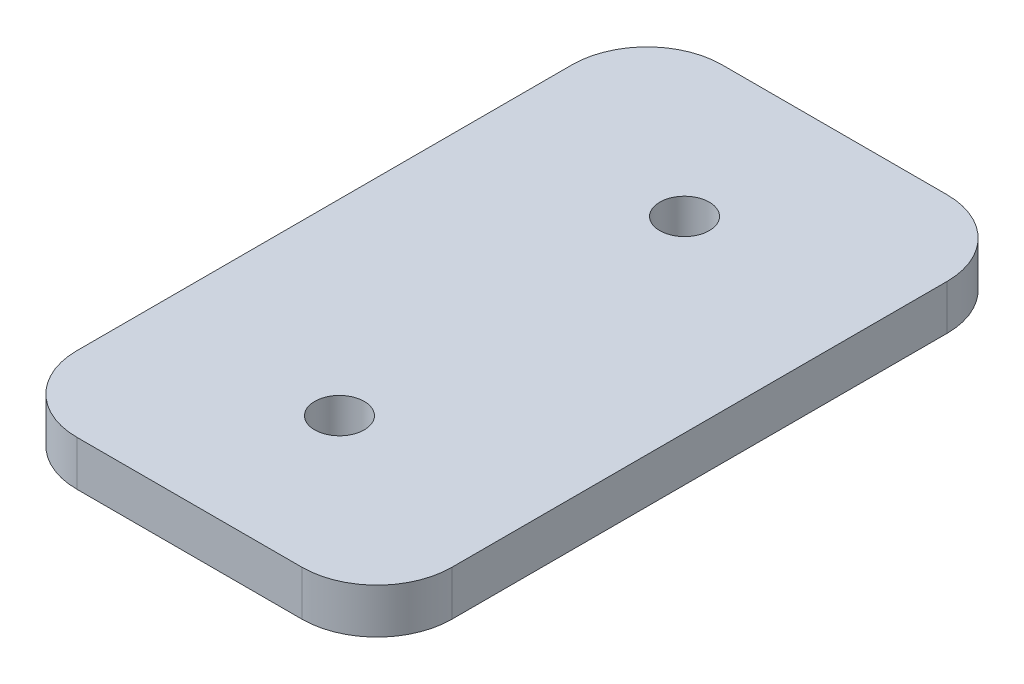
ISO-10303-21;
HEADER;
FILE_DESCRIPTION(('STEP AP214'),'2;1');
FILE_NAME('part.step','',(''),(''),'','','');
FILE_SCHEMA(('AUTOMOTIVE_DESIGN { 1 0 10303 214 1 1 1 1 }'));
ENDSEC;
DATA;
#1=APPLICATION_CONTEXT('core data for automotive mechanical design processes');
#2=APPLICATION_PROTOCOL_DEFINITION('international standard','automotive_design',2000,#1);
#3=PRODUCT_CONTEXT('',#1,'mechanical');
#4=PRODUCT('Part','Part','',(#3));
#5=PRODUCT_RELATED_PRODUCT_CATEGORY('part','',(#4));
#6=PRODUCT_DEFINITION_FORMATION('','',#4);
#7=PRODUCT_DEFINITION_CONTEXT('part definition',#1,'design');
#8=PRODUCT_DEFINITION('design','',#6,#7);
#9=PRODUCT_DEFINITION_SHAPE('','',#8);
#10=(LENGTH_UNIT() NAMED_UNIT(*) SI_UNIT(.MILLI.,.METRE.));
#11=(NAMED_UNIT(*) PLANE_ANGLE_UNIT() SI_UNIT($,.RADIAN.));
#12=(NAMED_UNIT(*) SI_UNIT($,.STERADIAN.) SOLID_ANGLE_UNIT());
#13=UNCERTAINTY_MEASURE_WITH_UNIT(LENGTH_MEASURE(1.E-05),#10,'distance_accuracy_value','');
#14=(GEOMETRIC_REPRESENTATION_CONTEXT(3) GLOBAL_UNCERTAINTY_ASSIGNED_CONTEXT((#13)) GLOBAL_UNIT_ASSIGNED_CONTEXT((#10,
#11,#12)) REPRESENTATION_CONTEXT('',''));
#15=CARTESIAN_POINT('',(0.,0.,0.));
#16=DIRECTION('',(0.,0.,1.));
#17=DIRECTION('',(1.,0.,0.));
#18=AXIS2_PLACEMENT_3D('',#15,#16,#17);
#19=CARTESIAN_POINT('',(346.23106012291,19.,-46.000000000003));
#20=DIRECTION('',(-0.999999999999929,0.,0.));
#21=DIRECTION('',(0.,0.,1.00000000000006));
#22=AXIS2_PLACEMENT_3D('',#19,#20,#21);
#23=PLANE('',#22);
#24=DIRECTION('',(0.,0.,1.00000000000006));
#25=VECTOR('',#24,1.);
#26=CARTESIAN_POINT('',(346.23106012291,25.,-46.000000000003));
#27=LINE('',#26,#25);
#28=CARTESIAN_POINT('',(346.231060122911,25.,-36.0000000000027));
#29=VERTEX_POINT('',#28);
#30=CARTESIAN_POINT('',(346.231060122911,25.,30.0000000000036));
#31=VERTEX_POINT('',#30);
#32=EDGE_CURVE('E126',#29,#31,#27,.T.);
#33=ORIENTED_EDGE('',*,*,#32,.F.);
#34=DIRECTION('',(0.,-1.,0.));
#35=VECTOR('',#34,1.);
#36=CARTESIAN_POINT('',(346.231060122911,19.,-36.0000000000027));
#37=LINE('',#36,#35);
#38=CARTESIAN_POINT('',(346.231060122911,19.,-36.0000000000027));
#39=VERTEX_POINT('',#38);
#40=EDGE_CURVE('E110',#29,#39,#37,.T.);
#41=ORIENTED_EDGE('',*,*,#40,.T.);
#42=DIRECTION('',(0.,0.,1.00000000000006));
#43=VECTOR('',#42,1.);
#44=CARTESIAN_POINT('',(346.23106012291,19.,-46.000000000003));
#45=LINE('',#44,#43);
#46=CARTESIAN_POINT('',(346.231060122911,19.,30.0000000000036));
#47=VERTEX_POINT('',#46);
#48=EDGE_CURVE('E123',#39,#47,#45,.T.);
#49=ORIENTED_EDGE('',*,*,#48,.T.);
#50=DIRECTION('',(0.,-1.,0.));
#51=VECTOR('',#50,1.);
#52=CARTESIAN_POINT('',(346.231060122911,19.,30.0000000000036));
#53=LINE('',#52,#51);
#54=EDGE_CURVE('E129',#47,#31,#53,.F.);
#55=ORIENTED_EDGE('',*,*,#54,.T.);
#56=EDGE_LOOP('',(#33,#41,#49,#55));
#57=FACE_BOUND('',#56,.T.);
#58=ADVANCED_FACE('F38',(#57),#23,.T.);
#59=CARTESIAN_POINT('',(396.231060122906,24.9999999999999,-46.0000000000034));
#60=DIRECTION('',(0.,1.,0.));
#61=DIRECTION('',(-0.999999999999929,0.,0.));
#62=AXIS2_PLACEMENT_3D('',#59,#60,#61);
#63=PLANE('',#62);
#64=CARTESIAN_POINT('',(371.231060122908,25.,-26.0000000000015));
#65=DIRECTION('',(0.,-1.,0.));
#66=DIRECTION('',(0.999999999999929,0.,0.));
#67=AXIS2_PLACEMENT_3D('',#64,#65,#66);
#68=CIRCLE('',#67,3.30000000000003);
#69=CARTESIAN_POINT('',(374.531060122908,25.,-26.0000000000015));
#70=VERTEX_POINT('',#69);
#71=EDGE_CURVE('E196',#70,#70,#68,.T.);
#72=ORIENTED_EDGE('',*,*,#71,.T.);
#73=EDGE_LOOP('',(#72));
#74=FACE_BOUND('',#73,.T.);
#75=CARTESIAN_POINT('',(371.231060122909,25.,20.000000000003));
#76=DIRECTION('',(0.,-1.,0.));
#77=DIRECTION('',(-0.999999999999929,0.,0.));
#78=AXIS2_PLACEMENT_3D('',#75,#76,#77);
#79=CIRCLE('',#78,3.30000000000003);
#80=CARTESIAN_POINT('',(367.93106012291,25.,20.000000000003));
#81=VERTEX_POINT('',#80);
#82=EDGE_CURVE('E264',#81,#81,#79,.T.);
#83=ORIENTED_EDGE('',*,*,#82,.T.);
#84=EDGE_LOOP('',(#83));
#85=FACE_BOUND('',#84,.T.);
#86=DIRECTION('',(-0.999999999999929,0.,0.));
#87=VECTOR('',#86,1.);
#88=CARTESIAN_POINT('',(396.231060122906,24.9999999999999,-46.0000000000034));
#89=LINE('',#88,#87);
#90=CARTESIAN_POINT('',(386.231060122907,25.,-46.0000000000028));
#91=VERTEX_POINT('',#90);
#92=CARTESIAN_POINT('',(356.231060122909,25.,-46.0000000000027));
#93=VERTEX_POINT('',#92);
#94=EDGE_CURVE('E136',#91,#93,#89,.T.);
#95=ORIENTED_EDGE('',*,*,#94,.T.);
#96=CARTESIAN_POINT('',(356.231060122909,25.,-36.0000000000017));
#97=DIRECTION('',(0.,1.,0.));
#98=DIRECTION('',(-0.999999999999929,0.,0.));
#99=AXIS2_PLACEMENT_3D('',#96,#97,#98);
#100=CIRCLE('',#99,10.);
#101=EDGE_CURVE('E168',#93,#29,#100,.T.);
#102=ORIENTED_EDGE('',*,*,#101,.T.);
#103=ORIENTED_EDGE('',*,*,#32,.T.);
#104=CARTESIAN_POINT('',(356.23106012291,25.,30.0000000000042));
#105=DIRECTION('',(0.,1.,0.));
#106=DIRECTION('',(-0.999999999999929,0.,0.));
#107=AXIS2_PLACEMENT_3D('',#104,#105,#106);
#108=CIRCLE('',#107,10.);
#109=CARTESIAN_POINT('',(356.23106012291,25.,40.0000000000044));
#110=VERTEX_POINT('',#109);
#111=EDGE_CURVE('E163',#31,#110,#108,.T.);
#112=ORIENTED_EDGE('',*,*,#111,.T.);
#113=DIRECTION('',(-0.999999999999929,0.,0.));
#114=VECTOR('',#113,1.);
#115=CARTESIAN_POINT('',(396.231060122907,24.9999999999999,40.0000000000042));
#116=LINE('',#115,#114);
#117=CARTESIAN_POINT('',(386.231060122908,25.,40.0000000000046));
#118=VERTEX_POINT('',#117);
#119=EDGE_CURVE('E183',#118,#110,#116,.T.);
#120=ORIENTED_EDGE('',*,*,#119,.F.);
#121=CARTESIAN_POINT('',(386.231060122908,25.,30.0000000000038));
#122=DIRECTION('',(0.,1.,0.));
#123=DIRECTION('',(-0.999999999999929,0.,0.));
#124=AXIS2_PLACEMENT_3D('',#121,#122,#123);
#125=CIRCLE('',#124,10.);
#126=CARTESIAN_POINT('',(396.231060122908,24.9999999999999,30.0000000000035));
#127=VERTEX_POINT('',#126);
#128=EDGE_CURVE('E54',#118,#127,#125,.T.);
#129=ORIENTED_EDGE('',*,*,#128,.T.);
#130=DIRECTION('',(0.,0.,1.00000000000006));
#131=VECTOR('',#130,1.);
#132=CARTESIAN_POINT('',(396.231060122906,24.9999999999999,-46.0000000000034));
#133=LINE('',#132,#131);
#134=CARTESIAN_POINT('',(396.231060122908,24.9999999999999,-36.0000000000011));
#135=VERTEX_POINT('',#134);
#136=EDGE_CURVE('E142',#135,#127,#133,.T.);
#137=ORIENTED_EDGE('',*,*,#136,.F.);
#138=CARTESIAN_POINT('',(386.231060122907,25.,-36.0000000000022));
#139=DIRECTION('',(0.,1.,0.));
#140=DIRECTION('',(-0.999999999999929,0.,0.));
#141=AXIS2_PLACEMENT_3D('',#138,#139,#140);
#142=CIRCLE('',#141,10.);
#143=EDGE_CURVE('E62',#135,#91,#142,.T.);
#144=ORIENTED_EDGE('',*,*,#143,.T.);
#145=EDGE_LOOP('',(#95,#102,#103,#112,#120,#129,#137,#144));
#146=FACE_BOUND('',#145,.T.);
#147=ADVANCED_FACE('F188',(#74,#85,#146),#63,.T.);
#148=CARTESIAN_POINT('',(396.231060122906,19.,-46.0000000000034));
#149=DIRECTION('',(0.999999999999929,0.,0.));
#150=DIRECTION('',(0.,0.,-1.00000000000006));
#151=AXIS2_PLACEMENT_3D('',#148,#149,#150);
#152=PLANE('',#151);
#153=DIRECTION('',(0.,0.,1.00000000000006));
#154=VECTOR('',#153,1.);
#155=CARTESIAN_POINT('',(396.231060122906,19.,-46.0000000000034));
#156=LINE('',#155,#154);
#157=CARTESIAN_POINT('',(396.231060122908,19.,-36.0000000000011));
#158=VERTEX_POINT('',#157);
#159=CARTESIAN_POINT('',(396.231060122908,19.,30.0000000000035));
#160=VERTEX_POINT('',#159);
#161=EDGE_CURVE('E135',#158,#160,#156,.T.);
#162=ORIENTED_EDGE('',*,*,#161,.F.);
#163=DIRECTION('',(0.,1.,0.));
#164=VECTOR('',#163,1.);
#165=CARTESIAN_POINT('',(396.231060122908,24.9999999999999,-36.0000000000011));
#166=LINE('',#165,#164);
#167=EDGE_CURVE('E174',#158,#135,#166,.T.);
#168=ORIENTED_EDGE('',*,*,#167,.T.);
#169=ORIENTED_EDGE('',*,*,#136,.T.);
#170=DIRECTION('',(0.,1.,0.));
#171=VECTOR('',#170,1.);
#172=CARTESIAN_POINT('',(396.231060122908,19.,30.0000000000035));
#173=LINE('',#172,#171);
#174=EDGE_CURVE('E171',#127,#160,#173,.F.);
#175=ORIENTED_EDGE('',*,*,#174,.T.);
#176=EDGE_LOOP('',(#162,#168,#169,#175));
#177=FACE_BOUND('',#176,.T.);
#178=ADVANCED_FACE('F205',(#177),#152,.T.);
#179=CARTESIAN_POINT('',(396.231060122906,19.,-46.0000000000034));
#180=DIRECTION('',(0.,-1.,0.));
#181=DIRECTION('',(0.,0.,-1.00000000000006));
#182=AXIS2_PLACEMENT_3D('',#179,#180,#181);
#183=PLANE('',#182);
#184=CARTESIAN_POINT('',(371.231060122908,19.,-26.0000000000015));
#185=DIRECTION('',(0.,-1.,0.));
#186=DIRECTION('',(0.999999999999929,0.,0.));
#187=AXIS2_PLACEMENT_3D('',#184,#185,#186);
#188=CIRCLE('',#187,3.30000000000003);
#189=CARTESIAN_POINT('',(374.531060122908,19.,-26.0000000000015));
#190=VERTEX_POINT('',#189);
#191=EDGE_CURVE('E258',#190,#190,#188,.T.);
#192=ORIENTED_EDGE('',*,*,#191,.F.);
#193=EDGE_LOOP('',(#192));
#194=FACE_BOUND('',#193,.T.);
#195=CARTESIAN_POINT('',(371.231060122909,19.,20.000000000003));
#196=DIRECTION('',(0.,-1.,0.));
#197=DIRECTION('',(-0.999999999999929,0.,0.));
#198=AXIS2_PLACEMENT_3D('',#195,#196,#197);
#199=CIRCLE('',#198,3.30000000000003);
#200=CARTESIAN_POINT('',(367.93106012291,19.,20.000000000003));
#201=VERTEX_POINT('',#200);
#202=EDGE_CURVE('E261',#201,#201,#199,.T.);
#203=ORIENTED_EDGE('',*,*,#202,.F.);
#204=EDGE_LOOP('',(#203));
#205=FACE_BOUND('',#204,.T.);
#206=ORIENTED_EDGE('',*,*,#48,.F.);
#207=CARTESIAN_POINT('',(356.231060122909,19.,-36.0000000000017));
#208=DIRECTION('',(0.,-1.,0.));
#209=DIRECTION('',(0.,0.,-1.00000000000006));
#210=AXIS2_PLACEMENT_3D('',#207,#208,#209);
#211=CIRCLE('',#210,10.);
#212=CARTESIAN_POINT('',(356.231060122909,19.,-46.0000000000027));
#213=VERTEX_POINT('',#212);
#214=EDGE_CURVE('E106',#39,#213,#211,.T.);
#215=ORIENTED_EDGE('',*,*,#214,.T.);
#216=DIRECTION('',(0.999999999999929,0.,0.));
#217=VECTOR('',#216,1.);
#218=CARTESIAN_POINT('',(396.231060122906,19.,-46.0000000000034));
#219=LINE('',#218,#217);
#220=CARTESIAN_POINT('',(386.231060122907,19.,-46.0000000000028));
#221=VERTEX_POINT('',#220);
#222=EDGE_CURVE('E146',#213,#221,#219,.T.);
#223=ORIENTED_EDGE('',*,*,#222,.T.);
#224=CARTESIAN_POINT('',(386.231060122907,19.,-36.0000000000022));
#225=DIRECTION('',(0.,-1.,0.));
#226=DIRECTION('',(0.,0.,-1.00000000000006));
#227=AXIS2_PLACEMENT_3D('',#224,#225,#226);
#228=CIRCLE('',#227,10.);
#229=EDGE_CURVE('E118',#221,#158,#228,.T.);
#230=ORIENTED_EDGE('',*,*,#229,.T.);
#231=ORIENTED_EDGE('',*,*,#161,.T.);
#232=CARTESIAN_POINT('',(386.231060122908,19.,30.0000000000038));
#233=DIRECTION('',(0.,-1.,0.));
#234=DIRECTION('',(0.,0.,-1.00000000000006));
#235=AXIS2_PLACEMENT_3D('',#232,#233,#234);
#236=CIRCLE('',#235,10.);
#237=CARTESIAN_POINT('',(386.231060122908,19.,40.0000000000046));
#238=VERTEX_POINT('',#237);
#239=EDGE_CURVE('E128',#160,#238,#236,.T.);
#240=ORIENTED_EDGE('',*,*,#239,.T.);
#241=DIRECTION('',(0.999999999999929,0.,0.));
#242=VECTOR('',#241,1.);
#243=CARTESIAN_POINT('',(396.231060122907,19.,40.0000000000042));
#244=LINE('',#243,#242);
#245=CARTESIAN_POINT('',(356.23106012291,19.,40.0000000000044));
#246=VERTEX_POINT('',#245);
#247=EDGE_CURVE('E185',#246,#238,#244,.T.);
#248=ORIENTED_EDGE('',*,*,#247,.F.);
#249=CARTESIAN_POINT('',(356.23106012291,19.,30.0000000000042));
#250=DIRECTION('',(0.,-1.,0.));
#251=DIRECTION('',(0.,0.,-1.00000000000006));
#252=AXIS2_PLACEMENT_3D('',#249,#250,#251);
#253=CIRCLE('',#252,10.);
#254=EDGE_CURVE('E133',#246,#47,#253,.T.);
#255=ORIENTED_EDGE('',*,*,#254,.T.);
#256=EDGE_LOOP('',(#206,#215,#223,#230,#231,#240,#248,#255));
#257=FACE_BOUND('',#256,.T.);
#258=ADVANCED_FACE('F131',(#194,#205,#257),#183,.T.);
#259=CARTESIAN_POINT('',(0.,0.,-46.0000000000027));
#260=DIRECTION('',(0.,0.,1.00000000000006));
#261=DIRECTION('',(0.999999999999929,0.,0.));
#262=AXIS2_PLACEMENT_3D('',#259,#260,#261);
#263=PLANE('',#262);
#264=ORIENTED_EDGE('',*,*,#222,.F.);
#265=DIRECTION('',(0.,-1.,0.));
#266=VECTOR('',#265,1.);
#267=CARTESIAN_POINT('',(356.231060122909,25.,-46.0000000000027));
#268=LINE('',#267,#266);
#269=EDGE_CURVE('E111',#213,#93,#268,.F.);
#270=ORIENTED_EDGE('',*,*,#269,.T.);
#271=ORIENTED_EDGE('',*,*,#94,.F.);
#272=DIRECTION('',(0.,1.,0.));
#273=VECTOR('',#272,1.);
#274=CARTESIAN_POINT('',(386.231060122907,19.,-46.0000000000028));
#275=LINE('',#274,#273);
#276=EDGE_CURVE('E117',#91,#221,#275,.F.);
#277=ORIENTED_EDGE('',*,*,#276,.T.);
#278=EDGE_LOOP('',(#264,#270,#271,#277));
#279=FACE_BOUND('',#278,.T.);
#280=ADVANCED_FACE('F210',(#279),#263,.F.);
#281=CARTESIAN_POINT('',(0.,0.,40.0000000000028));
#282=DIRECTION('',(0.,0.,1.00000000000006));
#283=DIRECTION('',(0.999999999999929,0.,0.));
#284=AXIS2_PLACEMENT_3D('',#281,#282,#283);
#285=PLANE('',#284);
#286=ORIENTED_EDGE('',*,*,#119,.T.);
#287=DIRECTION('',(0.,-1.,0.));
#288=VECTOR('',#287,1.);
#289=CARTESIAN_POINT('',(356.23106012291,0.,40.0000000000044));
#290=LINE('',#289,#288);
#291=EDGE_CURVE('E11',#110,#246,#290,.T.);
#292=ORIENTED_EDGE('',*,*,#291,.T.);
#293=ORIENTED_EDGE('',*,*,#247,.T.);
#294=DIRECTION('',(0.,1.,0.));
#295=VECTOR('',#294,1.);
#296=CARTESIAN_POINT('',(386.231060122908,0.,40.0000000000046));
#297=LINE('',#296,#295);
#298=EDGE_CURVE('E47',#238,#118,#297,.T.);
#299=ORIENTED_EDGE('',*,*,#298,.T.);
#300=EDGE_LOOP('',(#286,#292,#293,#299));
#301=FACE_BOUND('',#300,.T.);
#302=ADVANCED_FACE('F182',(#301),#285,.T.);
#303=CARTESIAN_POINT('',(371.231060122909,25.,20.000000000003));
#304=DIRECTION('',(0.,-1.,0.));
#305=DIRECTION('',(0.999999999999929,0.,0.));
#306=AXIS2_PLACEMENT_3D('',#303,#304,#305);
#307=CYLINDRICAL_SURFACE('',#306,3.30000000000003);
#308=ORIENTED_EDGE('',*,*,#82,.F.);
#309=EDGE_LOOP('',(#308));
#310=FACE_BOUND('',#309,.T.);
#311=ORIENTED_EDGE('',*,*,#202,.T.);
#312=EDGE_LOOP('',(#311));
#313=FACE_BOUND('',#312,.T.);
#314=ADVANCED_FACE('F234',(#310,#313),#307,.F.);
#315=CARTESIAN_POINT('',(371.231060122908,25.,-26.0000000000015));
#316=DIRECTION('',(0.,-1.,0.));
#317=DIRECTION('',(0.999999999999929,0.,0.));
#318=AXIS2_PLACEMENT_3D('',#315,#316,#317);
#319=CYLINDRICAL_SURFACE('',#318,3.30000000000003);
#320=ORIENTED_EDGE('',*,*,#71,.F.);
#321=EDGE_LOOP('',(#320));
#322=FACE_BOUND('',#321,.T.);
#323=ORIENTED_EDGE('',*,*,#191,.T.);
#324=EDGE_LOOP('',(#323));
#325=FACE_BOUND('',#324,.T.);
#326=ADVANCED_FACE('F230',(#322,#325),#319,.F.);
#327=CARTESIAN_POINT('',(356.231060122909,19.,-36.0000000000017));
#328=DIRECTION('',(0.,1.,0.));
#329=DIRECTION('',(0.,0.,1.00000000000006));
#330=AXIS2_PLACEMENT_3D('',#327,#328,#329);
#331=CYLINDRICAL_SURFACE('',#330,10.);
#332=ORIENTED_EDGE('',*,*,#101,.F.);
#333=ORIENTED_EDGE('',*,*,#269,.F.);
#334=ORIENTED_EDGE('',*,*,#214,.F.);
#335=ORIENTED_EDGE('',*,*,#40,.F.);
#336=EDGE_LOOP('',(#332,#333,#334,#335));
#337=FACE_BOUND('',#336,.T.);
#338=ADVANCED_FACE('F109',(#337),#331,.T.);
#339=CARTESIAN_POINT('',(386.231060122907,19.,-36.0000000000022));
#340=DIRECTION('',(0.,-1.,0.));
#341=DIRECTION('',(0.,0.,-1.00000000000006));
#342=AXIS2_PLACEMENT_3D('',#339,#340,#341);
#343=CYLINDRICAL_SURFACE('',#342,10.);
#344=ORIENTED_EDGE('',*,*,#229,.F.);
#345=ORIENTED_EDGE('',*,*,#276,.F.);
#346=ORIENTED_EDGE('',*,*,#143,.F.);
#347=ORIENTED_EDGE('',*,*,#167,.F.);
#348=EDGE_LOOP('',(#344,#345,#346,#347));
#349=FACE_BOUND('',#348,.T.);
#350=ADVANCED_FACE('F207',(#349),#343,.T.);
#351=CARTESIAN_POINT('',(356.23106012291,0.,30.0000000000042));
#352=DIRECTION('',(0.,-1.,0.));
#353=DIRECTION('',(0.,0.,-1.00000000000006));
#354=AXIS2_PLACEMENT_3D('',#351,#352,#353);
#355=CYLINDRICAL_SURFACE('',#354,10.);
#356=ORIENTED_EDGE('',*,*,#111,.F.);
#357=ORIENTED_EDGE('',*,*,#54,.F.);
#358=ORIENTED_EDGE('',*,*,#254,.F.);
#359=ORIENTED_EDGE('',*,*,#291,.F.);
#360=EDGE_LOOP('',(#356,#357,#358,#359));
#361=FACE_BOUND('',#360,.T.);
#362=ADVANCED_FACE('F212',(#361),#355,.T.);
#363=CARTESIAN_POINT('',(386.231060122908,0.,30.0000000000038));
#364=DIRECTION('',(0.,1.,0.));
#365=DIRECTION('',(0.,0.,1.00000000000006));
#366=AXIS2_PLACEMENT_3D('',#363,#364,#365);
#367=CYLINDRICAL_SURFACE('',#366,10.);
#368=ORIENTED_EDGE('',*,*,#239,.F.);
#369=ORIENTED_EDGE('',*,*,#174,.F.);
#370=ORIENTED_EDGE('',*,*,#128,.F.);
#371=ORIENTED_EDGE('',*,*,#298,.F.);
#372=EDGE_LOOP('',(#368,#369,#370,#371));
#373=FACE_BOUND('',#372,.T.);
#374=ADVANCED_FACE('F40',(#373),#367,.T.);
#375=CLOSED_SHELL('',(#58,#147,#178,#258,#280,#302,#314,#326,#338,#350,#362,#374));
#376=MANIFOLD_SOLID_BREP('B2',#375);
#377=ADVANCED_BREP_SHAPE_REPRESENTATION('',(#18,#376),#14);
#378=SHAPE_DEFINITION_REPRESENTATION(#9,#377);
ENDSEC;
END-ISO-10303-21;
